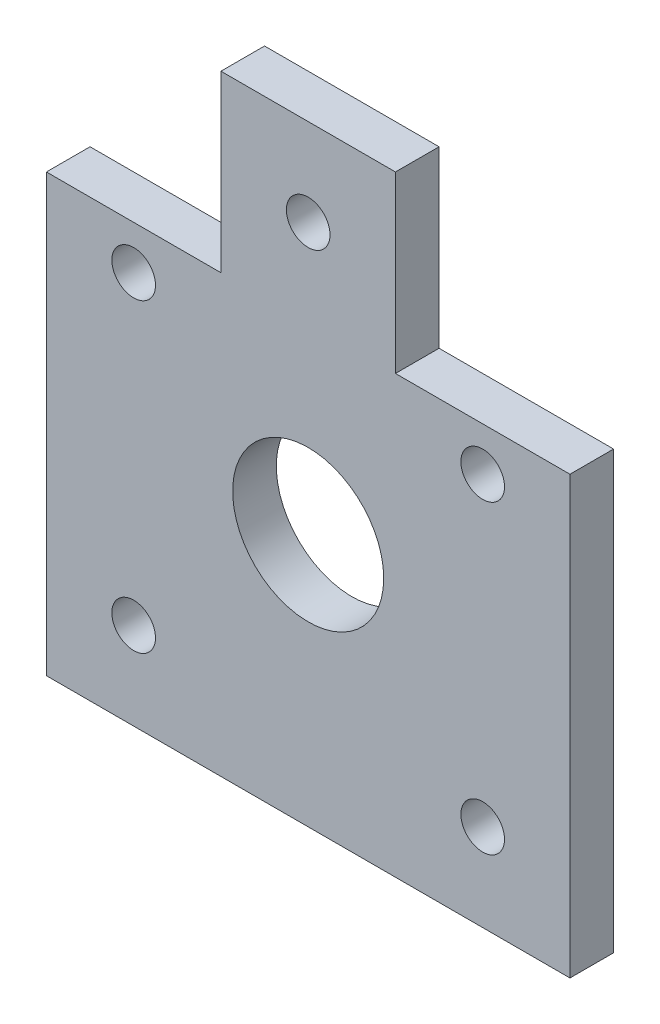
ISO-10303-21;
HEADER;
FILE_DESCRIPTION(('STEP AP214'),'2;1');
FILE_NAME('part.step','',(''),(''),'','','');
FILE_SCHEMA(('AUTOMOTIVE_DESIGN { 1 0 10303 214 1 1 1 1 }'));
ENDSEC;
DATA;
#1=APPLICATION_CONTEXT('core data for automotive mechanical design processes');
#2=APPLICATION_PROTOCOL_DEFINITION('international standard','automotive_design',2000,#1);
#3=PRODUCT_CONTEXT('',#1,'mechanical');
#4=PRODUCT('Part','Part','',(#3));
#5=PRODUCT_RELATED_PRODUCT_CATEGORY('part','',(#4));
#6=PRODUCT_DEFINITION_FORMATION('','',#4);
#7=PRODUCT_DEFINITION_CONTEXT('part definition',#1,'design');
#8=PRODUCT_DEFINITION('design','',#6,#7);
#9=PRODUCT_DEFINITION_SHAPE('','',#8);
#10=(LENGTH_UNIT() NAMED_UNIT(*) SI_UNIT(.MILLI.,.METRE.));
#11=(NAMED_UNIT(*) PLANE_ANGLE_UNIT() SI_UNIT($,.RADIAN.));
#12=(NAMED_UNIT(*) SI_UNIT($,.STERADIAN.) SOLID_ANGLE_UNIT());
#13=UNCERTAINTY_MEASURE_WITH_UNIT(LENGTH_MEASURE(1.E-05),#10,'distance_accuracy_value','');
#14=(GEOMETRIC_REPRESENTATION_CONTEXT(3) GLOBAL_UNCERTAINTY_ASSIGNED_CONTEXT((#13)) GLOBAL_UNIT_ASSIGNED_CONTEXT((#10,
#11,#12)) REPRESENTATION_CONTEXT('',''));
#15=CARTESIAN_POINT('',(0.,0.,0.));
#16=DIRECTION('',(0.,0.,1.));
#17=DIRECTION('',(1.,0.,0.));
#18=AXIS2_PLACEMENT_3D('',#15,#16,#17);
#19=CARTESIAN_POINT('',(0.,0.,3.175));
#20=DIRECTION('',(1.,0.,0.));
#21=DIRECTION('',(0.,0.,-1.));
#22=AXIS2_PLACEMENT_3D('',#19,#20,#21);
#23=PLANE('',#22);
#24=DIRECTION('',(0.,-1.,0.));
#25=VECTOR('',#24,1.);
#26=CARTESIAN_POINT('',(0.,0.,3.175));
#27=LINE('',#26,#25);
#28=CARTESIAN_POINT('',(0.,63.5,3.175));
#29=VERTEX_POINT('',#28);
#30=CARTESIAN_POINT('',(0.,0.,3.175));
#31=VERTEX_POINT('',#30);
#32=EDGE_CURVE('E126',#29,#31,#27,.T.);
#33=ORIENTED_EDGE('',*,*,#32,.F.);
#34=DIRECTION('',(0.,0.,1.));
#35=VECTOR('',#34,1.);
#36=CARTESIAN_POINT('',(0.,63.5,-3.176));
#37=LINE('',#36,#35);
#38=CARTESIAN_POINT('',(0.,63.5,-3.175));
#39=VERTEX_POINT('',#38);
#40=EDGE_CURVE('E176',#39,#29,#37,.T.);
#41=ORIENTED_EDGE('',*,*,#40,.F.);
#42=DIRECTION('',(0.,-1.,0.));
#43=VECTOR('',#42,1.);
#44=CARTESIAN_POINT('',(0.,0.,-3.175));
#45=LINE('',#44,#43);
#46=CARTESIAN_POINT('',(0.,0.,-3.175));
#47=VERTEX_POINT('',#46);
#48=EDGE_CURVE('E128',#39,#47,#45,.T.);
#49=ORIENTED_EDGE('',*,*,#48,.T.);
#50=DIRECTION('',(0.,0.,-1.));
#51=VECTOR('',#50,1.);
#52=CARTESIAN_POINT('',(0.,0.,3.175));
#53=LINE('',#52,#51);
#54=EDGE_CURVE('E11',#31,#47,#53,.T.);
#55=ORIENTED_EDGE('',*,*,#54,.F.);
#56=EDGE_LOOP('',(#33,#41,#49,#55));
#57=FACE_BOUND('',#56,.T.);
#58=ADVANCED_FACE('F33',(#57),#23,.F.);
#59=CARTESIAN_POINT('',(0.,0.,3.175));
#60=DIRECTION('',(0.,1.,0.));
#61=DIRECTION('',(0.,0.,1.));
#62=AXIS2_PLACEMENT_3D('',#59,#60,#61);
#63=PLANE('',#62);
#64=DIRECTION('',(1.,0.,0.));
#65=VECTOR('',#64,1.);
#66=CARTESIAN_POINT('',(0.,0.,-3.175));
#67=LINE('',#66,#65);
#68=CARTESIAN_POINT('',(76.2,0.,-3.175));
#69=VERTEX_POINT('',#68);
#70=EDGE_CURVE('E123',#47,#69,#67,.T.);
#71=ORIENTED_EDGE('',*,*,#70,.T.);
#72=DIRECTION('',(0.,0.,-1.));
#73=VECTOR('',#72,1.);
#74=CARTESIAN_POINT('',(76.2,0.,3.175));
#75=LINE('',#74,#73);
#76=CARTESIAN_POINT('',(76.2,0.,3.175));
#77=VERTEX_POINT('',#76);
#78=EDGE_CURVE('E40',#77,#69,#75,.T.);
#79=ORIENTED_EDGE('',*,*,#78,.F.);
#80=DIRECTION('',(1.,0.,0.));
#81=VECTOR('',#80,1.);
#82=CARTESIAN_POINT('',(0.,0.,3.175));
#83=LINE('',#82,#81);
#84=EDGE_CURVE('E139',#31,#77,#83,.T.);
#85=ORIENTED_EDGE('',*,*,#84,.F.);
#86=ORIENTED_EDGE('',*,*,#54,.T.);
#87=EDGE_LOOP('',(#71,#79,#85,#86));
#88=FACE_BOUND('',#87,.T.);
#89=ADVANCED_FACE('F164',(#88),#63,.F.);
#90=CARTESIAN_POINT('',(76.2,0.,3.175));
#91=DIRECTION('',(-1.,0.,0.));
#92=DIRECTION('',(0.,-1.,0.));
#93=AXIS2_PLACEMENT_3D('',#90,#91,#92);
#94=PLANE('',#93);
#95=DIRECTION('',(0.,1.,0.));
#96=VECTOR('',#95,1.);
#97=CARTESIAN_POINT('',(76.2,0.,-3.175));
#98=LINE('',#97,#96);
#99=CARTESIAN_POINT('',(76.2,63.5,-3.175));
#100=VERTEX_POINT('',#99);
#101=EDGE_CURVE('E114',#69,#100,#98,.T.);
#102=ORIENTED_EDGE('',*,*,#101,.T.);
#103=DIRECTION('',(0.,0.,1.));
#104=VECTOR('',#103,1.);
#105=CARTESIAN_POINT('',(76.2,63.5,-3.176));
#106=LINE('',#105,#104);
#107=CARTESIAN_POINT('',(76.2,63.5,3.175));
#108=VERTEX_POINT('',#107);
#109=EDGE_CURVE('E96',#100,#108,#106,.T.);
#110=ORIENTED_EDGE('',*,*,#109,.T.);
#111=DIRECTION('',(0.,1.,0.));
#112=VECTOR('',#111,1.);
#113=CARTESIAN_POINT('',(76.2,0.,3.175));
#114=LINE('',#113,#112);
#115=EDGE_CURVE('E133',#77,#108,#114,.T.);
#116=ORIENTED_EDGE('',*,*,#115,.F.);
#117=ORIENTED_EDGE('',*,*,#78,.T.);
#118=EDGE_LOOP('',(#102,#110,#116,#117));
#119=FACE_BOUND('',#118,.T.);
#120=ADVANCED_FACE('F120',(#119),#94,.F.);
#121=CARTESIAN_POINT('',(0.,88.9,3.175));
#122=DIRECTION('',(0.,-1.,0.));
#123=DIRECTION('',(0.,0.,-1.));
#124=AXIS2_PLACEMENT_3D('',#121,#122,#123);
#125=PLANE('',#124);
#126=DIRECTION('',(-1.,0.,0.));
#127=VECTOR('',#126,1.);
#128=CARTESIAN_POINT('',(0.,88.9,3.175));
#129=LINE('',#128,#127);
#130=CARTESIAN_POINT('',(50.8,88.9,3.175));
#131=VERTEX_POINT('',#130);
#132=CARTESIAN_POINT('',(25.4,88.9,3.175));
#133=VERTEX_POINT('',#132);
#134=EDGE_CURVE('E131',#131,#133,#129,.T.);
#135=ORIENTED_EDGE('',*,*,#134,.F.);
#136=DIRECTION('',(0.,0.,1.));
#137=VECTOR('',#136,1.);
#138=CARTESIAN_POINT('',(50.8,88.9,-3.176));
#139=LINE('',#138,#137);
#140=CARTESIAN_POINT('',(50.8,88.9,-3.175));
#141=VERTEX_POINT('',#140);
#142=EDGE_CURVE('E247',#141,#131,#139,.T.);
#143=ORIENTED_EDGE('',*,*,#142,.F.);
#144=DIRECTION('',(-1.,0.,0.));
#145=VECTOR('',#144,1.);
#146=CARTESIAN_POINT('',(0.,88.9,-3.175));
#147=LINE('',#146,#145);
#148=CARTESIAN_POINT('',(25.4,88.9,-3.175));
#149=VERTEX_POINT('',#148);
#150=EDGE_CURVE('E122',#141,#149,#147,.T.);
#151=ORIENTED_EDGE('',*,*,#150,.T.);
#152=DIRECTION('',(0.,0.,1.));
#153=VECTOR('',#152,1.);
#154=CARTESIAN_POINT('',(25.4,88.9,-3.176));
#155=LINE('',#154,#153);
#156=EDGE_CURVE('E169',#149,#133,#155,.T.);
#157=ORIENTED_EDGE('',*,*,#156,.T.);
#158=EDGE_LOOP('',(#135,#143,#151,#157));
#159=FACE_BOUND('',#158,.T.);
#160=ADVANCED_FACE('F210',(#159),#125,.F.);
#161=CARTESIAN_POINT('',(0.,0.,3.175));
#162=DIRECTION('',(0.,0.,-1.));
#163=DIRECTION('',(-1.,0.,0.));
#164=AXIS2_PLACEMENT_3D('',#161,#162,#163);
#165=PLANE('',#164);
#166=CARTESIAN_POINT('',(38.1,76.2,3.175));
#167=DIRECTION('',(0.,0.,1.));
#168=DIRECTION('',(1.,0.,0.));
#169=AXIS2_PLACEMENT_3D('',#166,#167,#168);
#170=CIRCLE('',#169,3.175);
#171=CARTESIAN_POINT('',(41.275,76.2,3.175));
#172=VERTEX_POINT('',#171);
#173=EDGE_CURVE('E178',#172,#172,#170,.T.);
#174=ORIENTED_EDGE('',*,*,#173,.F.);
#175=EDGE_LOOP('',(#174));
#176=FACE_BOUND('',#175,.T.);
#177=CARTESIAN_POINT('',(38.1,36.83,3.175));
#178=DIRECTION('',(0.,0.,1.));
#179=DIRECTION('',(1.,0.,0.));
#180=AXIS2_PLACEMENT_3D('',#177,#178,#179);
#181=CIRCLE('',#180,10.99185);
#182=CARTESIAN_POINT('',(49.09185,36.83,3.175));
#183=VERTEX_POINT('',#182);
#184=EDGE_CURVE('E156',#183,#183,#181,.T.);
#185=ORIENTED_EDGE('',*,*,#184,.F.);
#186=EDGE_LOOP('',(#185));
#187=FACE_BOUND('',#186,.T.);
#188=CARTESIAN_POINT('',(12.7,12.7,3.175));
#189=DIRECTION('',(0.,0.,1.));
#190=DIRECTION('',(1.,0.,0.));
#191=AXIS2_PLACEMENT_3D('',#188,#189,#190);
#192=CIRCLE('',#191,3.175);
#193=CARTESIAN_POINT('',(15.875,12.7,3.175));
#194=VERTEX_POINT('',#193);
#195=EDGE_CURVE('E197',#194,#194,#192,.T.);
#196=ORIENTED_EDGE('',*,*,#195,.F.);
#197=EDGE_LOOP('',(#196));
#198=FACE_BOUND('',#197,.T.);
#199=CARTESIAN_POINT('',(63.5,12.7,3.175));
#200=DIRECTION('',(0.,0.,1.));
#201=DIRECTION('',(1.,0.,0.));
#202=AXIS2_PLACEMENT_3D('',#199,#200,#201);
#203=CIRCLE('',#202,3.175);
#204=CARTESIAN_POINT('',(66.675,12.7,3.175));
#205=VERTEX_POINT('',#204);
#206=EDGE_CURVE('E148',#205,#205,#203,.T.);
#207=ORIENTED_EDGE('',*,*,#206,.F.);
#208=EDGE_LOOP('',(#207));
#209=FACE_BOUND('',#208,.T.);
#210=CARTESIAN_POINT('',(12.7,57.15,3.175));
#211=DIRECTION('',(0.,0.,1.));
#212=DIRECTION('',(1.,0.,0.));
#213=AXIS2_PLACEMENT_3D('',#210,#211,#212);
#214=CIRCLE('',#213,3.175);
#215=CARTESIAN_POINT('',(15.875,57.15,3.175));
#216=VERTEX_POINT('',#215);
#217=EDGE_CURVE('E187',#216,#216,#214,.T.);
#218=ORIENTED_EDGE('',*,*,#217,.F.);
#219=EDGE_LOOP('',(#218));
#220=FACE_BOUND('',#219,.T.);
#221=CARTESIAN_POINT('',(63.5,57.15,3.175));
#222=DIRECTION('',(0.,0.,1.));
#223=DIRECTION('',(1.,0.,0.));
#224=AXIS2_PLACEMENT_3D('',#221,#222,#223);
#225=CIRCLE('',#224,3.175);
#226=CARTESIAN_POINT('',(66.675,57.15,3.175));
#227=VERTEX_POINT('',#226);
#228=EDGE_CURVE('E107',#227,#227,#225,.T.);
#229=ORIENTED_EDGE('',*,*,#228,.F.);
#230=EDGE_LOOP('',(#229));
#231=FACE_BOUND('',#230,.T.);
#232=ORIENTED_EDGE('',*,*,#115,.T.);
#233=DIRECTION('',(1.,0.,0.));
#234=VECTOR('',#233,1.);
#235=CARTESIAN_POINT('',(76.2,63.5,3.175));
#236=LINE('',#235,#234);
#237=CARTESIAN_POINT('',(50.8,63.5,3.175));
#238=VERTEX_POINT('',#237);
#239=EDGE_CURVE('E102',#238,#108,#236,.T.);
#240=ORIENTED_EDGE('',*,*,#239,.F.);
#241=DIRECTION('',(0.,-1.,0.));
#242=VECTOR('',#241,1.);
#243=CARTESIAN_POINT('',(50.8,88.9,3.175));
#244=LINE('',#243,#242);
#245=EDGE_CURVE('E117',#131,#238,#244,.T.);
#246=ORIENTED_EDGE('',*,*,#245,.F.);
#247=ORIENTED_EDGE('',*,*,#134,.T.);
#248=DIRECTION('',(0.,1.,0.));
#249=VECTOR('',#248,1.);
#250=CARTESIAN_POINT('',(25.4,88.9,3.175));
#251=LINE('',#250,#249);
#252=CARTESIAN_POINT('',(25.4,63.5,3.175));
#253=VERTEX_POINT('',#252);
#254=EDGE_CURVE('E240',#253,#133,#251,.T.);
#255=ORIENTED_EDGE('',*,*,#254,.F.);
#256=DIRECTION('',(1.,0.,0.));
#257=VECTOR('',#256,1.);
#258=CARTESIAN_POINT('',(0.,63.5,3.175));
#259=LINE('',#258,#257);
#260=EDGE_CURVE('E241',#29,#253,#259,.T.);
#261=ORIENTED_EDGE('',*,*,#260,.F.);
#262=ORIENTED_EDGE('',*,*,#32,.T.);
#263=ORIENTED_EDGE('',*,*,#84,.T.);
#264=EDGE_LOOP('',(#232,#240,#246,#247,#255,#261,#262,#263));
#265=FACE_BOUND('',#264,.T.);
#266=ADVANCED_FACE('F160',(#176,#187,#198,#209,#220,#231,#265),#165,.F.);
#267=CARTESIAN_POINT('',(0.,0.,-3.175));
#268=DIRECTION('',(0.,0.,-1.));
#269=DIRECTION('',(-1.,0.,0.));
#270=AXIS2_PLACEMENT_3D('',#267,#268,#269);
#271=PLANE('',#270);
#272=DIRECTION('',(1.,0.,0.));
#273=VECTOR('',#272,1.);
#274=CARTESIAN_POINT('',(76.2,63.5,-3.175));
#275=LINE('',#274,#273);
#276=CARTESIAN_POINT('',(50.8,63.5,-3.175));
#277=VERTEX_POINT('',#276);
#278=EDGE_CURVE('E99',#277,#100,#275,.T.);
#279=ORIENTED_EDGE('',*,*,#278,.T.);
#280=ORIENTED_EDGE('',*,*,#101,.F.);
#281=ORIENTED_EDGE('',*,*,#70,.F.);
#282=ORIENTED_EDGE('',*,*,#48,.F.);
#283=DIRECTION('',(1.,0.,0.));
#284=VECTOR('',#283,1.);
#285=CARTESIAN_POINT('',(0.,63.5,-3.175));
#286=LINE('',#285,#284);
#287=CARTESIAN_POINT('',(25.4,63.5,-3.175));
#288=VERTEX_POINT('',#287);
#289=EDGE_CURVE('E167',#39,#288,#286,.T.);
#290=ORIENTED_EDGE('',*,*,#289,.T.);
#291=DIRECTION('',(0.,1.,0.));
#292=VECTOR('',#291,1.);
#293=CARTESIAN_POINT('',(25.4,88.9,-3.175));
#294=LINE('',#293,#292);
#295=EDGE_CURVE('E168',#288,#149,#294,.T.);
#296=ORIENTED_EDGE('',*,*,#295,.T.);
#297=ORIENTED_EDGE('',*,*,#150,.F.);
#298=DIRECTION('',(0.,-1.,0.));
#299=VECTOR('',#298,1.);
#300=CARTESIAN_POINT('',(50.8,88.9,-3.175));
#301=LINE('',#300,#299);
#302=EDGE_CURVE('E116',#141,#277,#301,.T.);
#303=ORIENTED_EDGE('',*,*,#302,.T.);
#304=EDGE_LOOP('',(#279,#280,#281,#282,#290,#296,#297,#303));
#305=FACE_BOUND('',#304,.T.);
#306=CARTESIAN_POINT('',(38.1,76.2,-3.175));
#307=DIRECTION('',(0.,0.,-1.));
#308=DIRECTION('',(-1.,0.,0.));
#309=AXIS2_PLACEMENT_3D('',#306,#307,#308);
#310=CIRCLE('',#309,3.175);
#311=CARTESIAN_POINT('',(34.925,76.2,-3.175));
#312=VERTEX_POINT('',#311);
#313=EDGE_CURVE('E181',#312,#312,#310,.F.);
#314=ORIENTED_EDGE('',*,*,#313,.T.);
#315=EDGE_LOOP('',(#314));
#316=FACE_BOUND('',#315,.T.);
#317=CARTESIAN_POINT('',(38.1,36.83,-3.175));
#318=DIRECTION('',(0.,0.,1.));
#319=DIRECTION('',(1.,0.,0.));
#320=AXIS2_PLACEMENT_3D('',#317,#318,#319);
#321=CIRCLE('',#320,10.99185);
#322=CARTESIAN_POINT('',(49.09185,36.83,-3.175));
#323=VERTEX_POINT('',#322);
#324=EDGE_CURVE('E199',#323,#323,#321,.T.);
#325=ORIENTED_EDGE('',*,*,#324,.T.);
#326=EDGE_LOOP('',(#325));
#327=FACE_BOUND('',#326,.T.);
#328=CARTESIAN_POINT('',(12.7,12.7,-3.175));
#329=DIRECTION('',(0.,0.,1.));
#330=DIRECTION('',(1.,0.,0.));
#331=AXIS2_PLACEMENT_3D('',#328,#329,#330);
#332=CIRCLE('',#331,3.175);
#333=CARTESIAN_POINT('',(15.875,12.7,-3.175));
#334=VERTEX_POINT('',#333);
#335=EDGE_CURVE('E153',#334,#334,#332,.T.);
#336=ORIENTED_EDGE('',*,*,#335,.T.);
#337=EDGE_LOOP('',(#336));
#338=FACE_BOUND('',#337,.T.);
#339=CARTESIAN_POINT('',(63.5,12.7,-3.175));
#340=DIRECTION('',(0.,0.,1.));
#341=DIRECTION('',(1.,0.,0.));
#342=AXIS2_PLACEMENT_3D('',#339,#340,#341);
#343=CIRCLE('',#342,3.175);
#344=CARTESIAN_POINT('',(66.675,12.7,-3.175));
#345=VERTEX_POINT('',#344);
#346=EDGE_CURVE('E142',#345,#345,#343,.T.);
#347=ORIENTED_EDGE('',*,*,#346,.T.);
#348=EDGE_LOOP('',(#347));
#349=FACE_BOUND('',#348,.T.);
#350=CARTESIAN_POINT('',(12.7,57.15,-3.175));
#351=DIRECTION('',(0.,0.,1.));
#352=DIRECTION('',(1.,0.,0.));
#353=AXIS2_PLACEMENT_3D('',#350,#351,#352);
#354=CIRCLE('',#353,3.175);
#355=CARTESIAN_POINT('',(15.875,57.15,-3.175));
#356=VERTEX_POINT('',#355);
#357=EDGE_CURVE('E184',#356,#356,#354,.T.);
#358=ORIENTED_EDGE('',*,*,#357,.T.);
#359=EDGE_LOOP('',(#358));
#360=FACE_BOUND('',#359,.T.);
#361=CARTESIAN_POINT('',(63.5,57.15,-3.175));
#362=DIRECTION('',(0.,0.,1.));
#363=DIRECTION('',(1.,0.,0.));
#364=AXIS2_PLACEMENT_3D('',#361,#362,#363);
#365=CIRCLE('',#364,3.175);
#366=CARTESIAN_POINT('',(66.675,57.15,-3.175));
#367=VERTEX_POINT('',#366);
#368=EDGE_CURVE('E190',#367,#367,#365,.T.);
#369=ORIENTED_EDGE('',*,*,#368,.T.);
#370=EDGE_LOOP('',(#369));
#371=FACE_BOUND('',#370,.T.);
#372=ADVANCED_FACE('F111',(#305,#316,#327,#338,#349,#360,#371),#271,.T.);
#373=CARTESIAN_POINT('',(63.5,57.15,-3.175));
#374=DIRECTION('',(0.,0.,1.));
#375=DIRECTION('',(1.,0.,0.));
#376=AXIS2_PLACEMENT_3D('',#373,#374,#375);
#377=CYLINDRICAL_SURFACE('',#376,3.175);
#378=ORIENTED_EDGE('',*,*,#368,.F.);
#379=EDGE_LOOP('',(#378));
#380=FACE_BOUND('',#379,.T.);
#381=ORIENTED_EDGE('',*,*,#228,.T.);
#382=EDGE_LOOP('',(#381));
#383=FACE_BOUND('',#382,.T.);
#384=ADVANCED_FACE('F221',(#380,#383),#377,.F.);
#385=CARTESIAN_POINT('',(12.7,57.15,-3.175));
#386=DIRECTION('',(0.,0.,1.));
#387=DIRECTION('',(1.,0.,0.));
#388=AXIS2_PLACEMENT_3D('',#385,#386,#387);
#389=CYLINDRICAL_SURFACE('',#388,3.175);
#390=ORIENTED_EDGE('',*,*,#357,.F.);
#391=EDGE_LOOP('',(#390));
#392=FACE_BOUND('',#391,.T.);
#393=ORIENTED_EDGE('',*,*,#217,.T.);
#394=EDGE_LOOP('',(#393));
#395=FACE_BOUND('',#394,.T.);
#396=ADVANCED_FACE('F223',(#392,#395),#389,.F.);
#397=CARTESIAN_POINT('',(63.5,12.7,-3.175));
#398=DIRECTION('',(0.,0.,1.));
#399=DIRECTION('',(1.,0.,0.));
#400=AXIS2_PLACEMENT_3D('',#397,#398,#399);
#401=CYLINDRICAL_SURFACE('',#400,3.175);
#402=ORIENTED_EDGE('',*,*,#346,.F.);
#403=EDGE_LOOP('',(#402));
#404=FACE_BOUND('',#403,.T.);
#405=ORIENTED_EDGE('',*,*,#206,.T.);
#406=EDGE_LOOP('',(#405));
#407=FACE_BOUND('',#406,.T.);
#408=ADVANCED_FACE('F230',(#404,#407),#401,.F.);
#409=CARTESIAN_POINT('',(12.7,12.7,-3.175));
#410=DIRECTION('',(0.,0.,1.));
#411=DIRECTION('',(1.,0.,0.));
#412=AXIS2_PLACEMENT_3D('',#409,#410,#411);
#413=CYLINDRICAL_SURFACE('',#412,3.175);
#414=ORIENTED_EDGE('',*,*,#335,.F.);
#415=EDGE_LOOP('',(#414));
#416=FACE_BOUND('',#415,.T.);
#417=ORIENTED_EDGE('',*,*,#195,.T.);
#418=EDGE_LOOP('',(#417));
#419=FACE_BOUND('',#418,.T.);
#420=ADVANCED_FACE('F272',(#416,#419),#413,.F.);
#421=CARTESIAN_POINT('',(38.1,36.83,-3.175));
#422=DIRECTION('',(0.,0.,1.));
#423=DIRECTION('',(1.,0.,0.));
#424=AXIS2_PLACEMENT_3D('',#421,#422,#423);
#425=CYLINDRICAL_SURFACE('',#424,10.99185);
#426=ORIENTED_EDGE('',*,*,#324,.F.);
#427=EDGE_LOOP('',(#426));
#428=FACE_BOUND('',#427,.T.);
#429=ORIENTED_EDGE('',*,*,#184,.T.);
#430=EDGE_LOOP('',(#429));
#431=FACE_BOUND('',#430,.T.);
#432=ADVANCED_FACE('F206',(#428,#431),#425,.F.);
#433=CARTESIAN_POINT('',(38.1,76.2,-3.176));
#434=DIRECTION('',(0.,0.,1.));
#435=DIRECTION('',(1.,0.,0.));
#436=AXIS2_PLACEMENT_3D('',#433,#434,#435);
#437=CYLINDRICAL_SURFACE('',#436,3.175);
#438=ORIENTED_EDGE('',*,*,#313,.F.);
#439=EDGE_LOOP('',(#438));
#440=FACE_BOUND('',#439,.T.);
#441=ORIENTED_EDGE('',*,*,#173,.T.);
#442=EDGE_LOOP('',(#441));
#443=FACE_BOUND('',#442,.T.);
#444=ADVANCED_FACE('F263',(#440,#443),#437,.F.);
#445=CARTESIAN_POINT('',(25.4,88.9,-3.176));
#446=DIRECTION('',(1.,0.,0.));
#447=DIRECTION('',(0.,1.,0.));
#448=AXIS2_PLACEMENT_3D('',#445,#446,#447);
#449=PLANE('',#448);
#450=DIRECTION('',(0.,0.,1.));
#451=VECTOR('',#450,1.);
#452=CARTESIAN_POINT('',(25.4,63.5,-3.176));
#453=LINE('',#452,#451);
#454=EDGE_CURVE('E55',#288,#253,#453,.T.);
#455=ORIENTED_EDGE('',*,*,#454,.T.);
#456=ORIENTED_EDGE('',*,*,#254,.T.);
#457=ORIENTED_EDGE('',*,*,#156,.F.);
#458=ORIENTED_EDGE('',*,*,#295,.F.);
#459=EDGE_LOOP('',(#455,#456,#457,#458));
#460=FACE_BOUND('',#459,.T.);
#461=ADVANCED_FACE('F254',(#460),#449,.F.);
#462=CARTESIAN_POINT('',(0.,63.5,-3.176));
#463=DIRECTION('',(0.,-1.,0.));
#464=DIRECTION('',(0.,0.,-1.));
#465=AXIS2_PLACEMENT_3D('',#462,#463,#464);
#466=PLANE('',#465);
#467=ORIENTED_EDGE('',*,*,#40,.T.);
#468=ORIENTED_EDGE('',*,*,#260,.T.);
#469=ORIENTED_EDGE('',*,*,#454,.F.);
#470=ORIENTED_EDGE('',*,*,#289,.F.);
#471=EDGE_LOOP('',(#467,#468,#469,#470));
#472=FACE_BOUND('',#471,.T.);
#473=ADVANCED_FACE('F255',(#472),#466,.F.);
#474=CARTESIAN_POINT('',(76.2,63.5,-3.176));
#475=DIRECTION('',(0.,-1.,0.));
#476=DIRECTION('',(0.,0.,-1.));
#477=AXIS2_PLACEMENT_3D('',#474,#475,#476);
#478=PLANE('',#477);
#479=DIRECTION('',(0.,0.,1.));
#480=VECTOR('',#479,1.);
#481=CARTESIAN_POINT('',(50.8,63.5,-3.176));
#482=LINE('',#481,#480);
#483=EDGE_CURVE('E47',#277,#238,#482,.T.);
#484=ORIENTED_EDGE('',*,*,#483,.T.);
#485=ORIENTED_EDGE('',*,*,#239,.T.);
#486=ORIENTED_EDGE('',*,*,#109,.F.);
#487=ORIENTED_EDGE('',*,*,#278,.F.);
#488=EDGE_LOOP('',(#484,#485,#486,#487));
#489=FACE_BOUND('',#488,.T.);
#490=ADVANCED_FACE('F98',(#489),#478,.F.);
#491=CARTESIAN_POINT('',(50.8,88.9,-3.176));
#492=DIRECTION('',(-1.,0.,0.));
#493=DIRECTION('',(0.,-1.,0.));
#494=AXIS2_PLACEMENT_3D('',#491,#492,#493);
#495=PLANE('',#494);
#496=ORIENTED_EDGE('',*,*,#142,.T.);
#497=ORIENTED_EDGE('',*,*,#245,.T.);
#498=ORIENTED_EDGE('',*,*,#483,.F.);
#499=ORIENTED_EDGE('',*,*,#302,.F.);
#500=EDGE_LOOP('',(#496,#497,#498,#499));
#501=FACE_BOUND('',#500,.T.);
#502=ADVANCED_FACE('F251',(#501),#495,.F.);
#503=CLOSED_SHELL('',(#58,#89,#120,#160,#266,#372,#384,#396,#408,#420,#432,#444,#461,#473,#490,#502));
#504=MANIFOLD_SOLID_BREP('B2',#503);
#505=ADVANCED_BREP_SHAPE_REPRESENTATION('',(#18,#504),#14);
#506=SHAPE_DEFINITION_REPRESENTATION(#9,#505);
ENDSEC;
END-ISO-10303-21;
